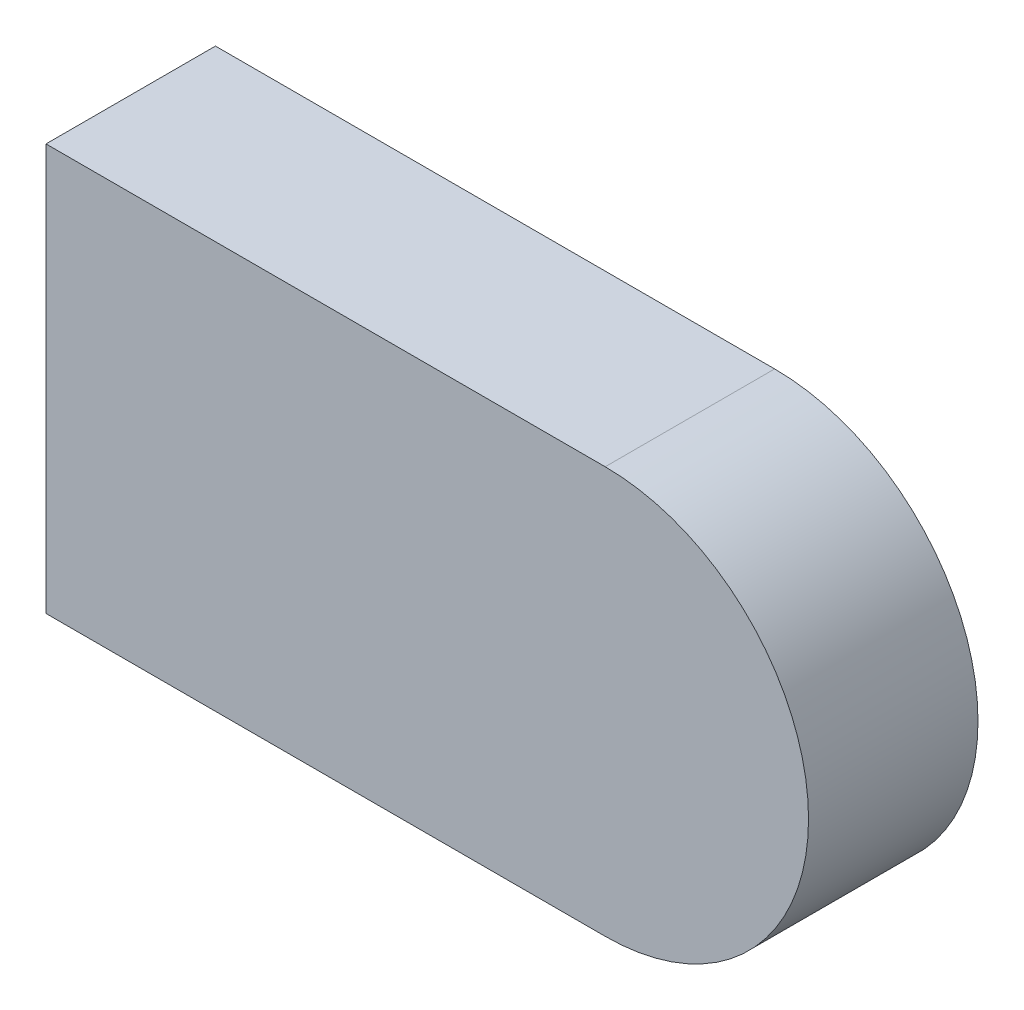
ISO-10303-21;
HEADER;
FILE_DESCRIPTION(('STEP AP214'),'2;1');
FILE_NAME('part.step','',(''),(''),'','','');
FILE_SCHEMA(('AUTOMOTIVE_DESIGN { 1 0 10303 214 1 1 1 1 }'));
ENDSEC;
DATA;
#1=APPLICATION_CONTEXT('core data for automotive mechanical design processes');
#2=APPLICATION_PROTOCOL_DEFINITION('international standard','automotive_design',2000,#1);
#3=PRODUCT_CONTEXT('',#1,'mechanical');
#4=PRODUCT('Part','Part','',(#3));
#5=PRODUCT_RELATED_PRODUCT_CATEGORY('part','',(#4));
#6=PRODUCT_DEFINITION_FORMATION('','',#4);
#7=PRODUCT_DEFINITION_CONTEXT('part definition',#1,'design');
#8=PRODUCT_DEFINITION('design','',#6,#7);
#9=PRODUCT_DEFINITION_SHAPE('','',#8);
#10=(LENGTH_UNIT() NAMED_UNIT(*) SI_UNIT(.MILLI.,.METRE.));
#11=(NAMED_UNIT(*) PLANE_ANGLE_UNIT() SI_UNIT($,.RADIAN.));
#12=(NAMED_UNIT(*) SI_UNIT($,.STERADIAN.) SOLID_ANGLE_UNIT());
#13=UNCERTAINTY_MEASURE_WITH_UNIT(LENGTH_MEASURE(1.E-05),#10,'distance_accuracy_value','');
#14=(GEOMETRIC_REPRESENTATION_CONTEXT(3) GLOBAL_UNCERTAINTY_ASSIGNED_CONTEXT((#13)) GLOBAL_UNIT_ASSIGNED_CONTEXT((#10,
#11,#12)) REPRESENTATION_CONTEXT('',''));
#15=CARTESIAN_POINT('',(0.,0.,0.));
#16=DIRECTION('',(0.,0.,1.));
#17=DIRECTION('',(1.,0.,0.));
#18=AXIS2_PLACEMENT_3D('',#15,#16,#17);
#19=CARTESIAN_POINT('',(-4.05,2.63,0.));
#20=DIRECTION('',(0.,1.,0.));
#21=DIRECTION('',(1.,0.,0.));
#22=AXIS2_PLACEMENT_3D('',#19,#20,#21);
#23=PLANE('',#22);
#24=DIRECTION('',(1.,0.,0.));
#25=VECTOR('',#24,1.);
#26=CARTESIAN_POINT('',(-4.05,2.63,0.));
#27=LINE('',#26,#25);
#28=CARTESIAN_POINT('',(-4.05,2.63,0.));
#29=VERTEX_POINT('',#28);
#30=CARTESIAN_POINT('',(-3.72,2.63,0.));
#31=VERTEX_POINT('',#30);
#32=EDGE_CURVE('E11',#29,#31,#27,.T.);
#33=ORIENTED_EDGE('',*,*,#32,.T.);
#34=DIRECTION('',(0.,0.,1.));
#35=VECTOR('',#34,1.);
#36=CARTESIAN_POINT('',(-3.72,2.63,0.));
#37=LINE('',#36,#35);
#38=CARTESIAN_POINT('',(-3.72,2.63,0.1));
#39=VERTEX_POINT('',#38);
#40=EDGE_CURVE('E24',#31,#39,#37,.T.);
#41=ORIENTED_EDGE('',*,*,#40,.T.);
#42=DIRECTION('',(1.,0.,0.));
#43=VECTOR('',#42,1.);
#44=CARTESIAN_POINT('',(-4.05,2.63,0.1));
#45=LINE('',#44,#43);
#46=CARTESIAN_POINT('',(-4.05,2.63,0.1));
#47=VERTEX_POINT('',#46);
#48=EDGE_CURVE('E88',#47,#39,#45,.T.);
#49=ORIENTED_EDGE('',*,*,#48,.F.);
#50=DIRECTION('',(0.,0.,1.));
#51=VECTOR('',#50,1.);
#52=CARTESIAN_POINT('',(-4.05,2.63,0.));
#53=LINE('',#52,#51);
#54=EDGE_CURVE('E36',#29,#47,#53,.T.);
#55=ORIENTED_EDGE('',*,*,#54,.F.);
#56=EDGE_LOOP('',(#33,#41,#49,#55));
#57=FACE_BOUND('',#56,.T.);
#58=ADVANCED_FACE('F17',(#57),#23,.F.);
#59=CARTESIAN_POINT('',(-3.72,2.75,0.));
#60=DIRECTION('',(0.,0.,-1.));
#61=DIRECTION('',(1.,0.,0.));
#62=AXIS2_PLACEMENT_3D('',#59,#60,#61);
#63=CYLINDRICAL_SURFACE('',#62,0.12);
#64=CARTESIAN_POINT('',(-3.72,2.75,0.));
#65=DIRECTION('',(0.,0.,1.));
#66=DIRECTION('',(1.,0.,0.));
#67=AXIS2_PLACEMENT_3D('',#64,#65,#66);
#68=CIRCLE('',#67,0.12);
#69=CARTESIAN_POINT('',(-3.72,2.87,0.));
#70=VERTEX_POINT('',#69);
#71=EDGE_CURVE('E85',#31,#70,#68,.T.);
#72=ORIENTED_EDGE('',*,*,#71,.T.);
#73=DIRECTION('',(0.,0.,1.));
#74=VECTOR('',#73,1.);
#75=CARTESIAN_POINT('',(-3.72,2.87,0.));
#76=LINE('',#75,#74);
#77=CARTESIAN_POINT('',(-3.72,2.87,0.1));
#78=VERTEX_POINT('',#77);
#79=EDGE_CURVE('E73',#70,#78,#76,.T.);
#80=ORIENTED_EDGE('',*,*,#79,.T.);
#81=CARTESIAN_POINT('',(-3.72,2.75,0.1));
#82=DIRECTION('',(0.,0.,1.));
#83=DIRECTION('',(1.,0.,0.));
#84=AXIS2_PLACEMENT_3D('',#81,#82,#83);
#85=CIRCLE('',#84,0.12);
#86=EDGE_CURVE('E66',#39,#78,#85,.T.);
#87=ORIENTED_EDGE('',*,*,#86,.F.);
#88=ORIENTED_EDGE('',*,*,#40,.F.);
#89=EDGE_LOOP('',(#72,#80,#87,#88));
#90=FACE_BOUND('',#89,.T.);
#91=ADVANCED_FACE('F89',(#90),#63,.T.);
#92=CARTESIAN_POINT('',(-4.05,2.87,0.));
#93=DIRECTION('',(0.,1.,0.));
#94=DIRECTION('',(1.,0.,0.));
#95=AXIS2_PLACEMENT_3D('',#92,#93,#94);
#96=PLANE('',#95);
#97=DIRECTION('',(0.,0.,1.));
#98=VECTOR('',#97,1.);
#99=CARTESIAN_POINT('',(-4.05,2.87,0.));
#100=LINE('',#99,#98);
#101=CARTESIAN_POINT('',(-4.05,2.87,0.));
#102=VERTEX_POINT('',#101);
#103=CARTESIAN_POINT('',(-4.05,2.87,0.1));
#104=VERTEX_POINT('',#103);
#105=EDGE_CURVE('E56',#102,#104,#100,.T.);
#106=ORIENTED_EDGE('',*,*,#105,.T.);
#107=DIRECTION('',(1.,0.,0.));
#108=VECTOR('',#107,1.);
#109=CARTESIAN_POINT('',(-4.05,2.87,0.1));
#110=LINE('',#109,#108);
#111=EDGE_CURVE('E67',#104,#78,#110,.T.);
#112=ORIENTED_EDGE('',*,*,#111,.T.);
#113=ORIENTED_EDGE('',*,*,#79,.F.);
#114=DIRECTION('',(1.,0.,0.));
#115=VECTOR('',#114,1.);
#116=CARTESIAN_POINT('',(-4.05,2.87,0.));
#117=LINE('',#116,#115);
#118=EDGE_CURVE('E71',#102,#70,#117,.T.);
#119=ORIENTED_EDGE('',*,*,#118,.F.);
#120=EDGE_LOOP('',(#106,#112,#113,#119));
#121=FACE_BOUND('',#120,.T.);
#122=ADVANCED_FACE('F72',(#121),#96,.T.);
#123=CARTESIAN_POINT('',(-4.05,2.63,0.));
#124=DIRECTION('',(-1.,0.,0.));
#125=DIRECTION('',(0.,1.,0.));
#126=AXIS2_PLACEMENT_3D('',#123,#124,#125);
#127=PLANE('',#126);
#128=ORIENTED_EDGE('',*,*,#54,.T.);
#129=DIRECTION('',(0.,1.,0.));
#130=VECTOR('',#129,1.);
#131=CARTESIAN_POINT('',(-4.05,2.63,0.1));
#132=LINE('',#131,#130);
#133=EDGE_CURVE('E62',#47,#104,#132,.T.);
#134=ORIENTED_EDGE('',*,*,#133,.T.);
#135=ORIENTED_EDGE('',*,*,#105,.F.);
#136=DIRECTION('',(0.,1.,0.));
#137=VECTOR('',#136,1.);
#138=CARTESIAN_POINT('',(-4.05,2.63,0.));
#139=LINE('',#138,#137);
#140=EDGE_CURVE('E60',#29,#102,#139,.T.);
#141=ORIENTED_EDGE('',*,*,#140,.F.);
#142=EDGE_LOOP('',(#128,#134,#135,#141));
#143=FACE_BOUND('',#142,.T.);
#144=ADVANCED_FACE('F58',(#143),#127,.T.);
#145=CARTESIAN_POINT('',(-3.849490847913,2.75,0.));
#146=DIRECTION('',(0.,0.,1.));
#147=DIRECTION('',(1.,0.,0.));
#148=AXIS2_PLACEMENT_3D('',#145,#146,#147);
#149=PLANE('',#148);
#150=ORIENTED_EDGE('',*,*,#140,.T.);
#151=ORIENTED_EDGE('',*,*,#118,.T.);
#152=ORIENTED_EDGE('',*,*,#71,.F.);
#153=ORIENTED_EDGE('',*,*,#32,.F.);
#154=EDGE_LOOP('',(#150,#151,#152,#153));
#155=FACE_BOUND('',#154,.T.);
#156=ADVANCED_FACE('F77',(#155),#149,.F.);
#157=CARTESIAN_POINT('',(-3.849490847913,2.75,0.1));
#158=DIRECTION('',(0.,0.,1.));
#159=DIRECTION('',(1.,0.,0.));
#160=AXIS2_PLACEMENT_3D('',#157,#158,#159);
#161=PLANE('',#160);
#162=ORIENTED_EDGE('',*,*,#48,.T.);
#163=ORIENTED_EDGE('',*,*,#86,.T.);
#164=ORIENTED_EDGE('',*,*,#111,.F.);
#165=ORIENTED_EDGE('',*,*,#133,.F.);
#166=EDGE_LOOP('',(#162,#163,#164,#165));
#167=FACE_BOUND('',#166,.T.);
#168=ADVANCED_FACE('F91',(#167),#161,.T.);
#169=CLOSED_SHELL('',(#58,#91,#122,#144,#156,#168));
#170=MANIFOLD_SOLID_BREP('B1',#169);
#171=ADVANCED_BREP_SHAPE_REPRESENTATION('',(#18,#170),#14);
#172=SHAPE_DEFINITION_REPRESENTATION(#9,#171);
ENDSEC;
END-ISO-10303-21;
